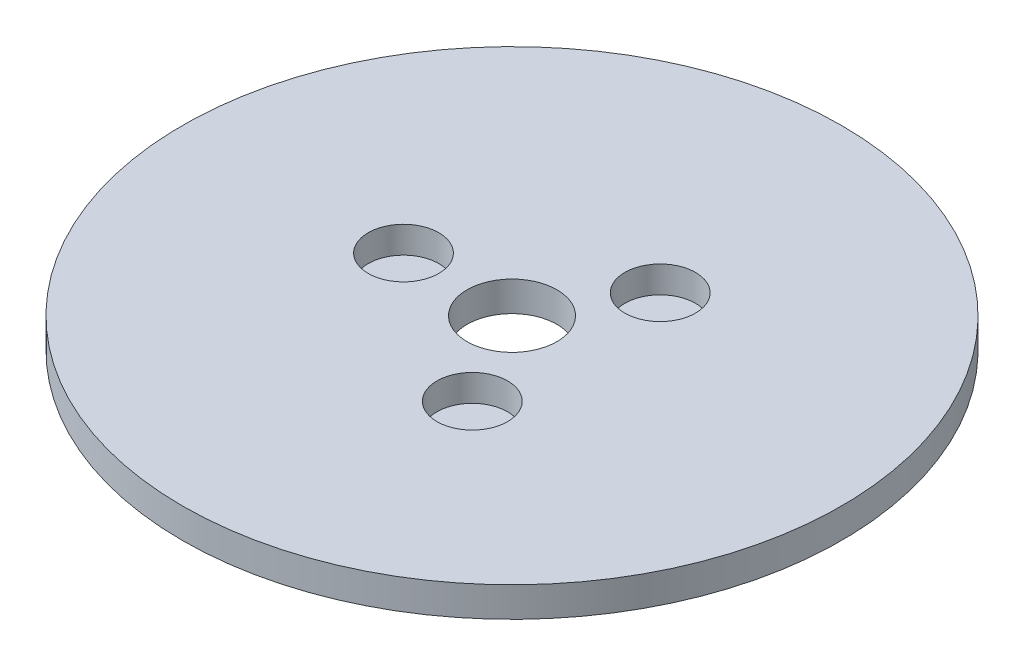
ISO-10303-21;
HEADER;
FILE_DESCRIPTION(('STEP AP214'),'2;1');
FILE_NAME('part.step','',(''),(''),'','','');
FILE_SCHEMA(('AUTOMOTIVE_DESIGN { 1 0 10303 214 1 1 1 1 }'));
ENDSEC;
DATA;
#1=APPLICATION_CONTEXT('core data for automotive mechanical design processes');
#2=APPLICATION_PROTOCOL_DEFINITION('international standard','automotive_design',2000,#1);
#3=PRODUCT_CONTEXT('',#1,'mechanical');
#4=PRODUCT('Part','Part','',(#3));
#5=PRODUCT_RELATED_PRODUCT_CATEGORY('part','',(#4));
#6=PRODUCT_DEFINITION_FORMATION('','',#4);
#7=PRODUCT_DEFINITION_CONTEXT('part definition',#1,'design');
#8=PRODUCT_DEFINITION('design','',#6,#7);
#9=PRODUCT_DEFINITION_SHAPE('','',#8);
#10=(LENGTH_UNIT() NAMED_UNIT(*) SI_UNIT(.MILLI.,.METRE.));
#11=(NAMED_UNIT(*) PLANE_ANGLE_UNIT() SI_UNIT($,.RADIAN.));
#12=(NAMED_UNIT(*) SI_UNIT($,.STERADIAN.) SOLID_ANGLE_UNIT());
#13=UNCERTAINTY_MEASURE_WITH_UNIT(LENGTH_MEASURE(1.E-05),#10,'distance_accuracy_value','');
#14=(GEOMETRIC_REPRESENTATION_CONTEXT(3) GLOBAL_UNCERTAINTY_ASSIGNED_CONTEXT((#13)) GLOBAL_UNIT_ASSIGNED_CONTEXT((#10,
#11,#12)) REPRESENTATION_CONTEXT('',''));
#15=CARTESIAN_POINT('',(0.,0.,0.));
#16=DIRECTION('',(0.,0.,1.));
#17=DIRECTION('',(1.,0.,0.));
#18=AXIS2_PLACEMENT_3D('',#15,#16,#17);
#19=CARTESIAN_POINT('',(0.,5.,0.));
#20=DIRECTION('',(0.,-1.,0.));
#21=DIRECTION('',(0.,0.,-1.));
#22=AXIS2_PLACEMENT_3D('',#19,#20,#21);
#23=CYLINDRICAL_SURFACE('',#22,55.);
#24=CARTESIAN_POINT('',(0.,5.,0.));
#25=DIRECTION('',(0.,1.,0.));
#26=DIRECTION('',(0.,0.,1.));
#27=AXIS2_PLACEMENT_3D('',#24,#25,#26);
#28=CIRCLE('',#27,55.);
#29=CARTESIAN_POINT('',(0.,5.,55.));
#30=VERTEX_POINT('',#29);
#31=EDGE_CURVE('E10',#30,#30,#28,.T.);
#32=ORIENTED_EDGE('',*,*,#31,.F.);
#33=EDGE_LOOP('',(#32));
#34=FACE_BOUND('',#33,.T.);
#35=CARTESIAN_POINT('',(0.,0.,0.));
#36=DIRECTION('',(0.,1.,0.));
#37=DIRECTION('',(0.,0.,1.));
#38=AXIS2_PLACEMENT_3D('',#35,#36,#37);
#39=CIRCLE('',#38,55.);
#40=CARTESIAN_POINT('',(0.,0.,55.));
#41=VERTEX_POINT('',#40);
#42=EDGE_CURVE('E37',#41,#41,#39,.T.);
#43=ORIENTED_EDGE('',*,*,#42,.T.);
#44=EDGE_LOOP('',(#43));
#45=FACE_BOUND('',#44,.T.);
#46=ADVANCED_FACE('F40',(#34,#45),#23,.T.);
#47=CARTESIAN_POINT('',(0.,5.,0.));
#48=DIRECTION('',(0.,1.,0.));
#49=DIRECTION('',(0.,0.,1.));
#50=AXIS2_PLACEMENT_3D('',#47,#48,#49);
#51=PLANE('',#50);
#52=CARTESIAN_POINT('',(9.05182711077318,5.,15.6782244571884));
#53=DIRECTION('',(0.,1.,0.));
#54=DIRECTION('',(0.866025403784436,0.,-0.500000000000004));
#55=AXIS2_PLACEMENT_3D('',#52,#53,#54);
#56=CIRCLE('',#55,5.89387422184481);
#57=CARTESIAN_POINT('',(14.156071913601,5.,12.731287346266));
#58=VERTEX_POINT('',#57);
#59=EDGE_CURVE('E70',#58,#58,#56,.T.);
#60=ORIENTED_EDGE('',*,*,#59,.F.);
#61=EDGE_LOOP('',(#60));
#62=FACE_BOUND('',#61,.T.);
#63=CARTESIAN_POINT('',(9.05182711077296,5.,-15.6782244571885));
#64=DIRECTION('',(0.,1.,0.));
#65=DIRECTION('',(-0.866025403784443,0.,-0.499999999999992));
#66=AXIS2_PLACEMENT_3D('',#63,#64,#65);
#67=CIRCLE('',#66,5.89387422184481);
#68=CARTESIAN_POINT('',(3.94758230794509,5.,-18.6251615681109));
#69=VERTEX_POINT('',#68);
#70=EDGE_CURVE('E61',#69,#69,#67,.T.);
#71=ORIENTED_EDGE('',*,*,#70,.F.);
#72=EDGE_LOOP('',(#71));
#73=FACE_BOUND('',#72,.T.);
#74=CARTESIAN_POINT('',(-18.1036542215462,5.,0.));
#75=DIRECTION('',(0.,1.,0.));
#76=DIRECTION('',(0.,0.,1.));
#77=AXIS2_PLACEMENT_3D('',#74,#75,#76);
#78=CIRCLE('',#77,5.89387422184481);
#79=CARTESIAN_POINT('',(-18.1036542215462,5.,5.89387422184481));
#80=VERTEX_POINT('',#79);
#81=EDGE_CURVE('E54',#80,#80,#78,.T.);
#82=ORIENTED_EDGE('',*,*,#81,.F.);
#83=EDGE_LOOP('',(#82));
#84=FACE_BOUND('',#83,.T.);
#85=CARTESIAN_POINT('',(0.,5.,0.));
#86=DIRECTION('',(0.,1.,0.));
#87=DIRECTION('',(0.,0.,1.));
#88=AXIS2_PLACEMENT_3D('',#85,#86,#87);
#89=CIRCLE('',#88,7.5);
#90=CARTESIAN_POINT('',(0.,5.,7.5));
#91=VERTEX_POINT('',#90);
#92=EDGE_CURVE('E50',#91,#91,#89,.T.);
#93=ORIENTED_EDGE('',*,*,#92,.F.);
#94=EDGE_LOOP('',(#93));
#95=FACE_BOUND('',#94,.T.);
#96=ORIENTED_EDGE('',*,*,#31,.T.);
#97=EDGE_LOOP('',(#96));
#98=FACE_BOUND('',#97,.T.);
#99=ADVANCED_FACE('F85',(#62,#73,#84,#95,#98),#51,.T.);
#100=CARTESIAN_POINT('',(0.,0.,0.));
#101=DIRECTION('',(0.,1.,0.));
#102=DIRECTION('',(0.,0.,1.));
#103=AXIS2_PLACEMENT_3D('',#100,#101,#102);
#104=PLANE('',#103);
#105=CARTESIAN_POINT('',(0.,0.,0.));
#106=DIRECTION('',(0.,1.,0.));
#107=DIRECTION('',(0.,0.,1.));
#108=AXIS2_PLACEMENT_3D('',#105,#106,#107);
#109=CIRCLE('',#108,7.5);
#110=CARTESIAN_POINT('',(0.,0.,7.5));
#111=VERTEX_POINT('',#110);
#112=EDGE_CURVE('E47',#111,#111,#109,.T.);
#113=ORIENTED_EDGE('',*,*,#112,.T.);
#114=EDGE_LOOP('',(#113));
#115=FACE_BOUND('',#114,.T.);
#116=ORIENTED_EDGE('',*,*,#42,.F.);
#117=EDGE_LOOP('',(#116));
#118=FACE_BOUND('',#117,.T.);
#119=ADVANCED_FACE('F84',(#115,#118),#104,.F.);
#120=CARTESIAN_POINT('',(0.,5.,0.));
#121=DIRECTION('',(0.,-1.,0.));
#122=DIRECTION('',(0.,0.,-1.));
#123=AXIS2_PLACEMENT_3D('',#120,#121,#122);
#124=CYLINDRICAL_SURFACE('',#123,7.5);
#125=ORIENTED_EDGE('',*,*,#92,.T.);
#126=EDGE_LOOP('',(#125));
#127=FACE_BOUND('',#126,.T.);
#128=ORIENTED_EDGE('',*,*,#112,.F.);
#129=EDGE_LOOP('',(#128));
#130=FACE_BOUND('',#129,.T.);
#131=ADVANCED_FACE('F91',(#127,#130),#124,.F.);
#132=CARTESIAN_POINT('',(-18.1036542215462,0.534447927489978,0.));
#133=DIRECTION('',(0.,1.,0.));
#134=DIRECTION('',(0.,0.,1.));
#135=AXIS2_PLACEMENT_3D('',#132,#133,#134);
#136=CYLINDRICAL_SURFACE('',#135,5.89387422184481);
#137=CARTESIAN_POINT('',(-18.1036542215462,0.534447927489978,0.));
#138=DIRECTION('',(0.,1.,0.));
#139=DIRECTION('',(0.,0.,1.));
#140=AXIS2_PLACEMENT_3D('',#137,#138,#139);
#141=CIRCLE('',#140,5.89387422184481);
#142=CARTESIAN_POINT('',(-18.1036542215462,0.534447927489978,5.89387422184481));
#143=VERTEX_POINT('',#142);
#144=EDGE_CURVE('E55',#143,#143,#141,.T.);
#145=ORIENTED_EDGE('',*,*,#144,.F.);
#146=EDGE_LOOP('',(#145));
#147=FACE_BOUND('',#146,.T.);
#148=ORIENTED_EDGE('',*,*,#81,.T.);
#149=EDGE_LOOP('',(#148));
#150=FACE_BOUND('',#149,.T.);
#151=ADVANCED_FACE('F96',(#147,#150),#136,.F.);
#152=CARTESIAN_POINT('',(-18.1036542215462,0.534447927489978,0.));
#153=DIRECTION('',(0.,1.,0.));
#154=DIRECTION('',(0.,0.,1.));
#155=AXIS2_PLACEMENT_3D('',#152,#153,#154);
#156=PLANE('',#155);
#157=ORIENTED_EDGE('',*,*,#144,.T.);
#158=EDGE_LOOP('',(#157));
#159=FACE_BOUND('',#158,.T.);
#160=ADVANCED_FACE('F127',(#159),#156,.T.);
#161=CARTESIAN_POINT('',(9.05182711077296,0.534447927489978,-15.6782244571885));
#162=DIRECTION('',(0.,1.,0.));
#163=DIRECTION('',(0.,0.,1.));
#164=AXIS2_PLACEMENT_3D('',#161,#162,#163);
#165=CYLINDRICAL_SURFACE('',#164,5.89387422184481);
#166=CARTESIAN_POINT('',(9.05182711077296,0.534447927489978,-15.6782244571885));
#167=DIRECTION('',(0.,1.,0.));
#168=DIRECTION('',(-0.866025403784443,0.,-0.499999999999992));
#169=AXIS2_PLACEMENT_3D('',#166,#167,#168);
#170=CIRCLE('',#169,5.89387422184481);
#171=CARTESIAN_POINT('',(3.94758230794509,0.534447927489978,-18.6251615681109));
#172=VERTEX_POINT('',#171);
#173=EDGE_CURVE('E63',#172,#172,#170,.T.);
#174=ORIENTED_EDGE('',*,*,#173,.F.);
#175=EDGE_LOOP('',(#174));
#176=FACE_BOUND('',#175,.T.);
#177=ORIENTED_EDGE('',*,*,#70,.T.);
#178=EDGE_LOOP('',(#177));
#179=FACE_BOUND('',#178,.T.);
#180=ADVANCED_FACE('F133',(#176,#179),#165,.F.);
#181=CARTESIAN_POINT('',(9.05182711077296,0.534447927489978,-15.6782244571885));
#182=DIRECTION('',(0.,1.,0.));
#183=DIRECTION('',(-0.866025403784443,0.,-0.499999999999992));
#184=AXIS2_PLACEMENT_3D('',#181,#182,#183);
#185=PLANE('',#184);
#186=ORIENTED_EDGE('',*,*,#173,.T.);
#187=EDGE_LOOP('',(#186));
#188=FACE_BOUND('',#187,.T.);
#189=ADVANCED_FACE('F77',(#188),#185,.T.);
#190=CARTESIAN_POINT('',(9.05182711077318,0.534447927489978,15.6782244571884));
#191=DIRECTION('',(0.,1.,0.));
#192=DIRECTION('',(0.,0.,1.));
#193=AXIS2_PLACEMENT_3D('',#190,#191,#192);
#194=CYLINDRICAL_SURFACE('',#193,5.89387422184481);
#195=CARTESIAN_POINT('',(9.05182711077318,0.534447927489978,15.6782244571884));
#196=DIRECTION('',(0.,1.,0.));
#197=DIRECTION('',(0.866025403784436,0.,-0.500000000000004));
#198=AXIS2_PLACEMENT_3D('',#195,#196,#197);
#199=CIRCLE('',#198,5.89387422184481);
#200=CARTESIAN_POINT('',(14.156071913601,0.534447927489978,12.731287346266));
#201=VERTEX_POINT('',#200);
#202=EDGE_CURVE('E59',#201,#201,#199,.T.);
#203=ORIENTED_EDGE('',*,*,#202,.F.);
#204=EDGE_LOOP('',(#203));
#205=FACE_BOUND('',#204,.T.);
#206=ORIENTED_EDGE('',*,*,#59,.T.);
#207=EDGE_LOOP('',(#206));
#208=FACE_BOUND('',#207,.T.);
#209=ADVANCED_FACE('F73',(#205,#208),#194,.F.);
#210=CARTESIAN_POINT('',(9.05182711077318,0.534447927489978,15.6782244571884));
#211=DIRECTION('',(0.,1.,0.));
#212=DIRECTION('',(0.866025403784436,0.,-0.500000000000004));
#213=AXIS2_PLACEMENT_3D('',#210,#211,#212);
#214=PLANE('',#213);
#215=ORIENTED_EDGE('',*,*,#202,.T.);
#216=EDGE_LOOP('',(#215));
#217=FACE_BOUND('',#216,.T.);
#218=ADVANCED_FACE('F71',(#217),#214,.T.);
#219=CLOSED_SHELL('',(#46,#99,#119,#131,#151,#160,#180,#189,#209,#218));
#220=MANIFOLD_SOLID_BREP('B2',#219);
#221=ADVANCED_BREP_SHAPE_REPRESENTATION('',(#18,#220),#14);
#222=SHAPE_DEFINITION_REPRESENTATION(#9,#221);
ENDSEC;
END-ISO-10303-21;
